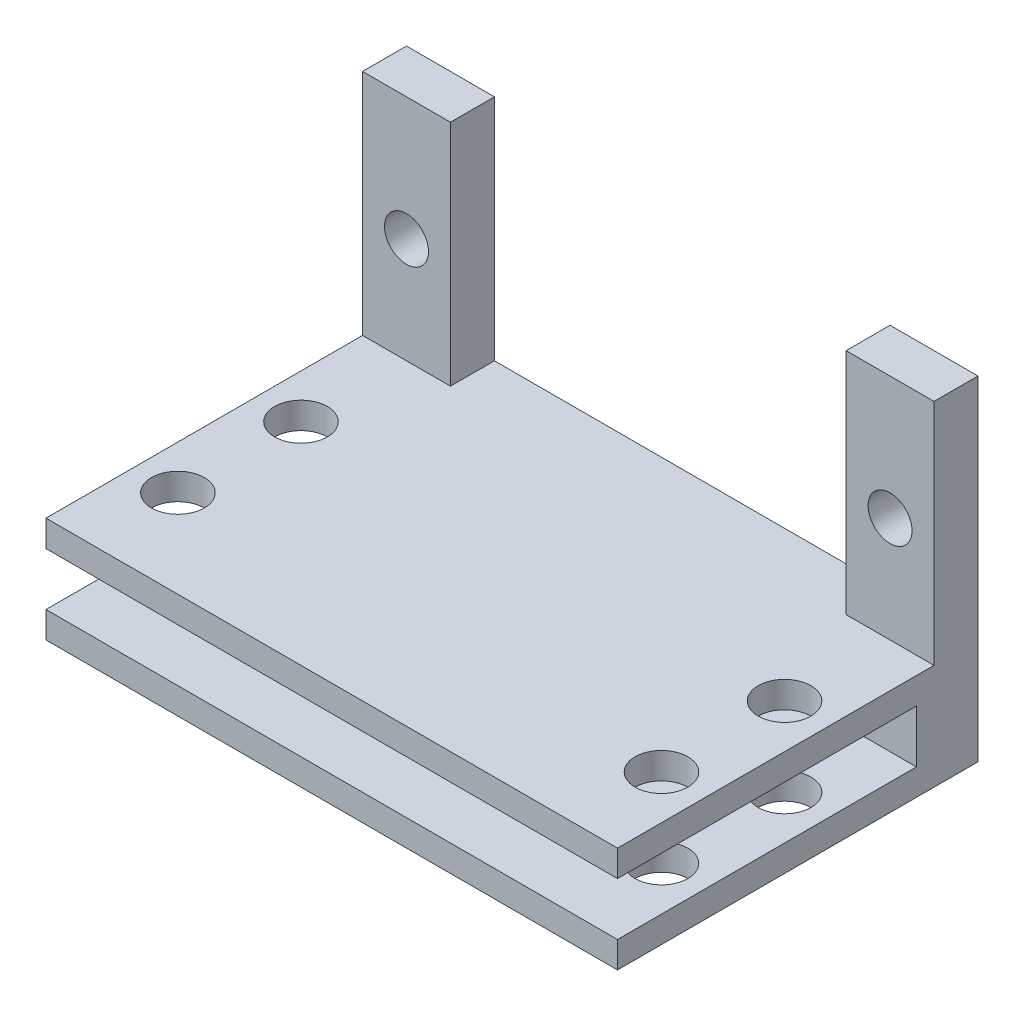
ISO-10303-21;
HEADER;
FILE_DESCRIPTION(('STEP AP214'),'2;1');
FILE_NAME('part.step','',(''),(''),'','','');
FILE_SCHEMA(('AUTOMOTIVE_DESIGN { 1 0 10303 214 1 1 1 1 }'));
ENDSEC;
DATA;
#1=APPLICATION_CONTEXT('core data for automotive mechanical design processes');
#2=APPLICATION_PROTOCOL_DEFINITION('international standard','automotive_design',2000,#1);
#3=PRODUCT_CONTEXT('',#1,'mechanical');
#4=PRODUCT('Part','Part','',(#3));
#5=PRODUCT_RELATED_PRODUCT_CATEGORY('part','',(#4));
#6=PRODUCT_DEFINITION_FORMATION('','',#4);
#7=PRODUCT_DEFINITION_CONTEXT('part definition',#1,'design');
#8=PRODUCT_DEFINITION('design','',#6,#7);
#9=PRODUCT_DEFINITION_SHAPE('','',#8);
#10=(LENGTH_UNIT() NAMED_UNIT(*) SI_UNIT(.MILLI.,.METRE.));
#11=(NAMED_UNIT(*) PLANE_ANGLE_UNIT() SI_UNIT($,.RADIAN.));
#12=(NAMED_UNIT(*) SI_UNIT($,.STERADIAN.) SOLID_ANGLE_UNIT());
#13=UNCERTAINTY_MEASURE_WITH_UNIT(LENGTH_MEASURE(1.E-05),#10,'distance_accuracy_value','');
#14=(GEOMETRIC_REPRESENTATION_CONTEXT(3) GLOBAL_UNCERTAINTY_ASSIGNED_CONTEXT((#13)) GLOBAL_UNIT_ASSIGNED_CONTEXT((#10,
#11,#12)) REPRESENTATION_CONTEXT('',''));
#15=CARTESIAN_POINT('',(0.,0.,0.));
#16=DIRECTION('',(0.,0.,1.));
#17=DIRECTION('',(1.,0.,0.));
#18=AXIS2_PLACEMENT_3D('',#15,#16,#17);
#19=CARTESIAN_POINT('',(0.,0.,20.5));
#20=DIRECTION('',(0.,1.,0.));
#21=DIRECTION('',(-1.,0.,0.));
#22=AXIS2_PLACEMENT_3D('',#19,#20,#21);
#23=PLANE('',#22);
#24=CARTESIAN_POINT('',(-13.75,0.,8.5));
#25=DIRECTION('',(0.,1.,0.));
#26=DIRECTION('',(-1.,0.,0.));
#27=AXIS2_PLACEMENT_3D('',#24,#25,#26);
#28=CIRCLE('',#27,1.5);
#29=CARTESIAN_POINT('',(-15.25,0.,8.5));
#30=VERTEX_POINT('',#29);
#31=EDGE_CURVE('E176',#30,#30,#28,.T.);
#32=ORIENTED_EDGE('',*,*,#31,.F.);
#33=EDGE_LOOP('',(#32));
#34=FACE_BOUND('',#33,.T.);
#35=CARTESIAN_POINT('',(-13.75,0.,15.5));
#36=DIRECTION('',(0.,1.,0.));
#37=DIRECTION('',(-1.,0.,0.));
#38=AXIS2_PLACEMENT_3D('',#35,#36,#37);
#39=CIRCLE('',#38,1.5);
#40=CARTESIAN_POINT('',(-15.25,0.,15.5));
#41=VERTEX_POINT('',#40);
#42=EDGE_CURVE('E417',#41,#41,#39,.T.);
#43=ORIENTED_EDGE('',*,*,#42,.F.);
#44=EDGE_LOOP('',(#43));
#45=FACE_BOUND('',#44,.T.);
#46=CARTESIAN_POINT('',(13.75,0.,15.5));
#47=DIRECTION('',(0.,1.,0.));
#48=DIRECTION('',(-1.,0.,0.));
#49=AXIS2_PLACEMENT_3D('',#46,#47,#48);
#50=CIRCLE('',#49,1.5);
#51=CARTESIAN_POINT('',(12.25,0.,15.5));
#52=VERTEX_POINT('',#51);
#53=EDGE_CURVE('E399',#52,#52,#50,.T.);
#54=ORIENTED_EDGE('',*,*,#53,.F.);
#55=EDGE_LOOP('',(#54));
#56=FACE_BOUND('',#55,.T.);
#57=CARTESIAN_POINT('',(13.75,0.,8.5));
#58=DIRECTION('',(0.,1.,0.));
#59=DIRECTION('',(-1.,0.,0.));
#60=AXIS2_PLACEMENT_3D('',#57,#58,#59);
#61=CIRCLE('',#60,1.5);
#62=CARTESIAN_POINT('',(12.25,0.,8.5));
#63=VERTEX_POINT('',#62);
#64=EDGE_CURVE('E408',#63,#63,#61,.T.);
#65=ORIENTED_EDGE('',*,*,#64,.F.);
#66=EDGE_LOOP('',(#65));
#67=FACE_BOUND('',#66,.T.);
#68=DIRECTION('',(1.,0.,0.));
#69=VECTOR('',#68,1.);
#70=CARTESIAN_POINT('',(0.,0.,0.));
#71=LINE('',#70,#69);
#72=CARTESIAN_POINT('',(-11.25,0.,0.));
#73=VERTEX_POINT('',#72);
#74=CARTESIAN_POINT('',(11.25,0.,0.));
#75=VERTEX_POINT('',#74);
#76=EDGE_CURVE('E220',#73,#75,#71,.T.);
#77=ORIENTED_EDGE('',*,*,#76,.F.);
#78=DIRECTION('',(0.,0.,-1.));
#79=VECTOR('',#78,1.);
#80=CARTESIAN_POINT('',(-11.25,0.,2.5));
#81=LINE('',#80,#79);
#82=CARTESIAN_POINT('',(-11.25,0.,2.5));
#83=VERTEX_POINT('',#82);
#84=EDGE_CURVE('E217',#83,#73,#81,.T.);
#85=ORIENTED_EDGE('',*,*,#84,.F.);
#86=DIRECTION('',(1.,0.,0.));
#87=VECTOR('',#86,1.);
#88=CARTESIAN_POINT('',(0.,0.,2.5));
#89=LINE('',#88,#87);
#90=CARTESIAN_POINT('',(-16.25,0.,2.5));
#91=VERTEX_POINT('',#90);
#92=EDGE_CURVE('E193',#91,#83,#89,.T.);
#93=ORIENTED_EDGE('',*,*,#92,.F.);
#94=DIRECTION('',(0.,0.,-1.));
#95=VECTOR('',#94,1.);
#96=CARTESIAN_POINT('',(-16.25,0.,20.5));
#97=LINE('',#96,#95);
#98=CARTESIAN_POINT('',(-16.25,0.,20.5));
#99=VERTEX_POINT('',#98);
#100=EDGE_CURVE('E237',#99,#91,#97,.T.);
#101=ORIENTED_EDGE('',*,*,#100,.F.);
#102=DIRECTION('',(1.,0.,0.));
#103=VECTOR('',#102,1.);
#104=CARTESIAN_POINT('',(0.,0.,20.5));
#105=LINE('',#104,#103);
#106=CARTESIAN_POINT('',(16.25,0.,20.5));
#107=VERTEX_POINT('',#106);
#108=EDGE_CURVE('E227',#99,#107,#105,.T.);
#109=ORIENTED_EDGE('',*,*,#108,.T.);
#110=DIRECTION('',(0.,0.,-1.));
#111=VECTOR('',#110,1.);
#112=CARTESIAN_POINT('',(16.25,0.,20.5));
#113=LINE('',#112,#111);
#114=CARTESIAN_POINT('',(16.25,0.,2.5));
#115=VERTEX_POINT('',#114);
#116=EDGE_CURVE('E240',#107,#115,#113,.T.);
#117=ORIENTED_EDGE('',*,*,#116,.T.);
#118=DIRECTION('',(1.,0.,0.));
#119=VECTOR('',#118,1.);
#120=CARTESIAN_POINT('',(0.,0.,2.5));
#121=LINE('',#120,#119);
#122=CARTESIAN_POINT('',(11.25,0.,2.5));
#123=VERTEX_POINT('',#122);
#124=EDGE_CURVE('E247',#123,#115,#121,.T.);
#125=ORIENTED_EDGE('',*,*,#124,.F.);
#126=DIRECTION('',(0.,0.,-1.));
#127=VECTOR('',#126,1.);
#128=CARTESIAN_POINT('',(11.25,0.,2.5));
#129=LINE('',#128,#127);
#130=EDGE_CURVE('E59',#123,#75,#129,.T.);
#131=ORIENTED_EDGE('',*,*,#130,.T.);
#132=EDGE_LOOP('',(#77,#85,#93,#101,#109,#117,#125,#131));
#133=FACE_BOUND('',#132,.T.);
#134=ADVANCED_FACE('F35',(#34,#45,#56,#67,#133),#23,.T.);
#135=CARTESIAN_POINT('',(16.25,0.,2.5));
#136=DIRECTION('',(-1.,0.,0.));
#137=DIRECTION('',(0.,0.,1.));
#138=AXIS2_PLACEMENT_3D('',#135,#136,#137);
#139=PLANE('',#138);
#140=DIRECTION('',(0.,1.,0.));
#141=VECTOR('',#140,1.);
#142=CARTESIAN_POINT('',(16.25,0.,0.));
#143=LINE('',#142,#141);
#144=CARTESIAN_POINT('',(16.25,-6.,0.));
#145=VERTEX_POINT('',#144);
#146=CARTESIAN_POINT('',(16.25,13.,0.));
#147=VERTEX_POINT('',#146);
#148=EDGE_CURVE('E246',#145,#147,#143,.T.);
#149=ORIENTED_EDGE('',*,*,#148,.T.);
#150=DIRECTION('',(0.,0.,-1.));
#151=VECTOR('',#150,1.);
#152=CARTESIAN_POINT('',(16.25,13.,2.5));
#153=LINE('',#152,#151);
#154=CARTESIAN_POINT('',(16.25,13.,2.5));
#155=VERTEX_POINT('',#154);
#156=EDGE_CURVE('E11',#155,#147,#153,.T.);
#157=ORIENTED_EDGE('',*,*,#156,.F.);
#158=DIRECTION('',(0.,1.,0.));
#159=VECTOR('',#158,1.);
#160=CARTESIAN_POINT('',(16.25,0.,2.5));
#161=LINE('',#160,#159);
#162=EDGE_CURVE('E80',#115,#155,#161,.T.);
#163=ORIENTED_EDGE('',*,*,#162,.F.);
#164=ORIENTED_EDGE('',*,*,#116,.F.);
#165=DIRECTION('',(0.,-1.,0.));
#166=VECTOR('',#165,1.);
#167=CARTESIAN_POINT('',(16.25,0.,20.5));
#168=LINE('',#167,#166);
#169=CARTESIAN_POINT('',(16.25,-1.5,20.5));
#170=VERTEX_POINT('',#169);
#171=EDGE_CURVE('E223',#107,#170,#168,.T.);
#172=ORIENTED_EDGE('',*,*,#171,.T.);
#173=DIRECTION('',(0.,0.,-1.));
#174=VECTOR('',#173,1.);
#175=CARTESIAN_POINT('',(16.25,-1.5,20.5));
#176=LINE('',#175,#174);
#177=CARTESIAN_POINT('',(16.25,-1.5,3.5));
#178=VERTEX_POINT('',#177);
#179=EDGE_CURVE('E243',#170,#178,#176,.T.);
#180=ORIENTED_EDGE('',*,*,#179,.T.);
#181=DIRECTION('',(0.,-1.,0.));
#182=VECTOR('',#181,1.);
#183=CARTESIAN_POINT('',(16.25,0.,3.5));
#184=LINE('',#183,#182);
#185=CARTESIAN_POINT('',(16.25,-4.5,3.5));
#186=VERTEX_POINT('',#185);
#187=EDGE_CURVE('E50',#178,#186,#184,.T.);
#188=ORIENTED_EDGE('',*,*,#187,.T.);
#189=DIRECTION('',(0.,0.,-1.));
#190=VECTOR('',#189,1.);
#191=CARTESIAN_POINT('',(16.25,-4.5,20.5));
#192=LINE('',#191,#190);
#193=CARTESIAN_POINT('',(16.25,-4.5,20.5));
#194=VERTEX_POINT('',#193);
#195=EDGE_CURVE('E166',#194,#186,#192,.T.);
#196=ORIENTED_EDGE('',*,*,#195,.F.);
#197=DIRECTION('',(0.,-1.,0.));
#198=VECTOR('',#197,1.);
#199=CARTESIAN_POINT('',(16.25,0.,20.5));
#200=LINE('',#199,#198);
#201=CARTESIAN_POINT('',(16.25,-6.,20.5));
#202=VERTEX_POINT('',#201);
#203=EDGE_CURVE('E151',#194,#202,#200,.T.);
#204=ORIENTED_EDGE('',*,*,#203,.T.);
#205=DIRECTION('',(0.,0.,-1.));
#206=VECTOR('',#205,1.);
#207=CARTESIAN_POINT('',(16.25,-6.,20.5));
#208=LINE('',#207,#206);
#209=EDGE_CURVE('E162',#202,#145,#208,.T.);
#210=ORIENTED_EDGE('',*,*,#209,.T.);
#211=EDGE_LOOP('',(#149,#157,#163,#164,#172,#180,#188,#196,#204,#210));
#212=FACE_BOUND('',#211,.T.);
#213=ADVANCED_FACE('F37',(#212),#139,.F.);
#214=CARTESIAN_POINT('',(0.,13.,2.5));
#215=DIRECTION('',(0.,-1.,0.));
#216=DIRECTION('',(1.,0.,0.));
#217=AXIS2_PLACEMENT_3D('',#214,#215,#216);
#218=PLANE('',#217);
#219=DIRECTION('',(-1.,0.,0.));
#220=VECTOR('',#219,1.);
#221=CARTESIAN_POINT('',(0.,13.,0.));
#222=LINE('',#221,#220);
#223=CARTESIAN_POINT('',(11.25,13.,0.));
#224=VERTEX_POINT('',#223);
#225=EDGE_CURVE('E259',#147,#224,#222,.T.);
#226=ORIENTED_EDGE('',*,*,#225,.T.);
#227=DIRECTION('',(0.,0.,-1.));
#228=VECTOR('',#227,1.);
#229=CARTESIAN_POINT('',(11.25,13.,2.5));
#230=LINE('',#229,#228);
#231=CARTESIAN_POINT('',(11.25,13.,2.5));
#232=VERTEX_POINT('',#231);
#233=EDGE_CURVE('E43',#232,#224,#230,.T.);
#234=ORIENTED_EDGE('',*,*,#233,.F.);
#235=DIRECTION('',(-1.,0.,0.));
#236=VECTOR('',#235,1.);
#237=CARTESIAN_POINT('',(0.,13.,2.5));
#238=LINE('',#237,#236);
#239=EDGE_CURVE('E251',#155,#232,#238,.T.);
#240=ORIENTED_EDGE('',*,*,#239,.F.);
#241=ORIENTED_EDGE('',*,*,#156,.T.);
#242=EDGE_LOOP('',(#226,#234,#240,#241));
#243=FACE_BOUND('',#242,.T.);
#244=ADVANCED_FACE('F277',(#243),#218,.F.);
#245=CARTESIAN_POINT('',(11.25,0.,2.5));
#246=DIRECTION('',(-1.,0.,0.));
#247=DIRECTION('',(0.,-1.,0.));
#248=AXIS2_PLACEMENT_3D('',#245,#246,#247);
#249=PLANE('',#248);
#250=DIRECTION('',(0.,1.,0.));
#251=VECTOR('',#250,1.);
#252=CARTESIAN_POINT('',(11.25,0.,0.));
#253=LINE('',#252,#251);
#254=EDGE_CURVE('E261',#75,#224,#253,.T.);
#255=ORIENTED_EDGE('',*,*,#254,.F.);
#256=ORIENTED_EDGE('',*,*,#130,.F.);
#257=DIRECTION('',(0.,1.,0.));
#258=VECTOR('',#257,1.);
#259=CARTESIAN_POINT('',(11.25,0.,2.5));
#260=LINE('',#259,#258);
#261=EDGE_CURVE('E253',#123,#232,#260,.T.);
#262=ORIENTED_EDGE('',*,*,#261,.T.);
#263=ORIENTED_EDGE('',*,*,#233,.T.);
#264=EDGE_LOOP('',(#255,#256,#262,#263));
#265=FACE_BOUND('',#264,.T.);
#266=ADVANCED_FACE('F274',(#265),#249,.T.);
#267=CARTESIAN_POINT('',(13.75,6.,2.5));
#268=DIRECTION('',(0.,0.,-1.));
#269=DIRECTION('',(-1.,0.,0.));
#270=AXIS2_PLACEMENT_3D('',#267,#268,#269);
#271=CYLINDRICAL_SURFACE('',#270,1.25);
#272=CARTESIAN_POINT('',(13.75,6.,2.5));
#273=DIRECTION('',(0.,0.,1.));
#274=DIRECTION('',(1.,0.,0.));
#275=AXIS2_PLACEMENT_3D('',#272,#273,#274);
#276=CIRCLE('',#275,1.25);
#277=CARTESIAN_POINT('',(15.,6.,2.5));
#278=VERTEX_POINT('',#277);
#279=EDGE_CURVE('E255',#278,#278,#276,.F.);
#280=ORIENTED_EDGE('',*,*,#279,.F.);
#281=EDGE_LOOP('',(#280));
#282=FACE_BOUND('',#281,.T.);
#283=CARTESIAN_POINT('',(13.75,6.,0.));
#284=DIRECTION('',(0.,0.,1.));
#285=DIRECTION('',(1.,0.,0.));
#286=AXIS2_PLACEMENT_3D('',#283,#284,#285);
#287=CIRCLE('',#286,1.25);
#288=CARTESIAN_POINT('',(15.,6.,0.));
#289=VERTEX_POINT('',#288);
#290=EDGE_CURVE('E249',#289,#289,#287,.F.);
#291=ORIENTED_EDGE('',*,*,#290,.T.);
#292=EDGE_LOOP('',(#291));
#293=FACE_BOUND('',#292,.T.);
#294=ADVANCED_FACE('F276',(#282,#293),#271,.F.);
#295=CARTESIAN_POINT('',(0.,0.,2.5));
#296=DIRECTION('',(0.,0.,1.));
#297=DIRECTION('',(1.,0.,0.));
#298=AXIS2_PLACEMENT_3D('',#295,#296,#297);
#299=PLANE('',#298);
#300=ORIENTED_EDGE('',*,*,#124,.T.);
#301=ORIENTED_EDGE('',*,*,#162,.T.);
#302=ORIENTED_EDGE('',*,*,#239,.T.);
#303=ORIENTED_EDGE('',*,*,#261,.F.);
#304=EDGE_LOOP('',(#300,#301,#302,#303));
#305=FACE_BOUND('',#304,.T.);
#306=ORIENTED_EDGE('',*,*,#279,.T.);
#307=EDGE_LOOP('',(#306));
#308=FACE_BOUND('',#307,.T.);
#309=ADVANCED_FACE('F271',(#305,#308),#299,.T.);
#310=CARTESIAN_POINT('',(0.,0.,0.));
#311=DIRECTION('',(0.,0.,1.));
#312=DIRECTION('',(1.,0.,0.));
#313=AXIS2_PLACEMENT_3D('',#310,#311,#312);
#314=PLANE('',#313);
#315=ORIENTED_EDGE('',*,*,#148,.F.);
#316=DIRECTION('',(1.,0.,0.));
#317=VECTOR('',#316,1.);
#318=CARTESIAN_POINT('',(0.,-6.,0.));
#319=LINE('',#318,#317);
#320=CARTESIAN_POINT('',(-16.25,-6.,0.));
#321=VERTEX_POINT('',#320);
#322=EDGE_CURVE('E158',#321,#145,#319,.T.);
#323=ORIENTED_EDGE('',*,*,#322,.F.);
#324=DIRECTION('',(0.,-1.,0.));
#325=VECTOR('',#324,1.);
#326=CARTESIAN_POINT('',(-16.25,0.,0.));
#327=LINE('',#326,#325);
#328=CARTESIAN_POINT('',(-16.25,13.,0.));
#329=VERTEX_POINT('',#328);
#330=EDGE_CURVE('E224',#329,#321,#327,.T.);
#331=ORIENTED_EDGE('',*,*,#330,.F.);
#332=DIRECTION('',(1.,0.,0.));
#333=VECTOR('',#332,1.);
#334=CARTESIAN_POINT('',(0.,13.,0.));
#335=LINE('',#334,#333);
#336=CARTESIAN_POINT('',(-11.25,13.,0.));
#337=VERTEX_POINT('',#336);
#338=EDGE_CURVE('E194',#329,#337,#335,.T.);
#339=ORIENTED_EDGE('',*,*,#338,.T.);
#340=DIRECTION('',(0.,1.,0.));
#341=VECTOR('',#340,1.);
#342=CARTESIAN_POINT('',(-11.25,0.,0.));
#343=LINE('',#342,#341);
#344=EDGE_CURVE('E208',#73,#337,#343,.T.);
#345=ORIENTED_EDGE('',*,*,#344,.F.);
#346=ORIENTED_EDGE('',*,*,#76,.T.);
#347=ORIENTED_EDGE('',*,*,#254,.T.);
#348=ORIENTED_EDGE('',*,*,#225,.F.);
#349=EDGE_LOOP('',(#315,#323,#331,#339,#345,#346,#347,#348));
#350=FACE_BOUND('',#349,.T.);
#351=ORIENTED_EDGE('',*,*,#290,.F.);
#352=EDGE_LOOP('',(#351));
#353=FACE_BOUND('',#352,.T.);
#354=CARTESIAN_POINT('',(-13.75,6.,0.));
#355=DIRECTION('',(0.,0.,1.));
#356=DIRECTION('',(1.,0.,0.));
#357=AXIS2_PLACEMENT_3D('',#354,#355,#356);
#358=CIRCLE('',#357,1.25);
#359=CARTESIAN_POINT('',(-12.5,6.,0.));
#360=VERTEX_POINT('',#359);
#361=EDGE_CURVE('E189',#360,#360,#358,.T.);
#362=ORIENTED_EDGE('',*,*,#361,.T.);
#363=EDGE_LOOP('',(#362));
#364=FACE_BOUND('',#363,.T.);
#365=ADVANCED_FACE('F301',(#350,#353,#364),#314,.F.);
#366=CARTESIAN_POINT('',(0.,-1.5,20.5));
#367=DIRECTION('',(0.,1.,0.));
#368=DIRECTION('',(-1.,0.,0.));
#369=AXIS2_PLACEMENT_3D('',#366,#367,#368);
#370=PLANE('',#369);
#371=CARTESIAN_POINT('',(-13.75,-1.5,8.5));
#372=DIRECTION('',(0.,1.,0.));
#373=DIRECTION('',(-1.,0.,0.));
#374=AXIS2_PLACEMENT_3D('',#371,#372,#373);
#375=CIRCLE('',#374,1.5);
#376=CARTESIAN_POINT('',(-15.25,-1.5,8.5));
#377=VERTEX_POINT('',#376);
#378=EDGE_CURVE('E423',#377,#377,#375,.T.);
#379=ORIENTED_EDGE('',*,*,#378,.T.);
#380=EDGE_LOOP('',(#379));
#381=FACE_BOUND('',#380,.T.);
#382=CARTESIAN_POINT('',(-13.75,-1.5,15.5));
#383=DIRECTION('',(0.,1.,0.));
#384=DIRECTION('',(-1.,0.,0.));
#385=AXIS2_PLACEMENT_3D('',#382,#383,#384);
#386=CIRCLE('',#385,1.5);
#387=CARTESIAN_POINT('',(-15.25,-1.5,15.5));
#388=VERTEX_POINT('',#387);
#389=EDGE_CURVE('E414',#388,#388,#386,.T.);
#390=ORIENTED_EDGE('',*,*,#389,.T.);
#391=EDGE_LOOP('',(#390));
#392=FACE_BOUND('',#391,.T.);
#393=CARTESIAN_POINT('',(13.75,-1.5,15.5));
#394=DIRECTION('',(0.,1.,0.));
#395=DIRECTION('',(-1.,0.,0.));
#396=AXIS2_PLACEMENT_3D('',#393,#394,#395);
#397=CIRCLE('',#396,1.5);
#398=CARTESIAN_POINT('',(12.25,-1.5,15.5));
#399=VERTEX_POINT('',#398);
#400=EDGE_CURVE('E402',#399,#399,#397,.T.);
#401=ORIENTED_EDGE('',*,*,#400,.T.);
#402=EDGE_LOOP('',(#401));
#403=FACE_BOUND('',#402,.T.);
#404=CARTESIAN_POINT('',(13.75,-1.5,8.5));
#405=DIRECTION('',(0.,1.,0.));
#406=DIRECTION('',(-1.,0.,0.));
#407=AXIS2_PLACEMENT_3D('',#404,#405,#406);
#408=CIRCLE('',#407,1.5);
#409=CARTESIAN_POINT('',(12.25,-1.5,8.5));
#410=VERTEX_POINT('',#409);
#411=EDGE_CURVE('E435',#410,#410,#408,.T.);
#412=ORIENTED_EDGE('',*,*,#411,.T.);
#413=EDGE_LOOP('',(#412));
#414=FACE_BOUND('',#413,.T.);
#415=DIRECTION('',(0.,0.,-1.));
#416=VECTOR('',#415,1.);
#417=CARTESIAN_POINT('',(-16.25,-1.5,20.5));
#418=LINE('',#417,#416);
#419=CARTESIAN_POINT('',(-16.25,-1.5,20.5));
#420=VERTEX_POINT('',#419);
#421=CARTESIAN_POINT('',(-16.25,-1.5,3.5));
#422=VERTEX_POINT('',#421);
#423=EDGE_CURVE('E232',#420,#422,#418,.T.);
#424=ORIENTED_EDGE('',*,*,#423,.T.);
#425=DIRECTION('',(1.,0.,0.));
#426=VECTOR('',#425,1.);
#427=CARTESIAN_POINT('',(0.,-1.5,3.5));
#428=LINE('',#427,#426);
#429=EDGE_CURVE('E184',#422,#178,#428,.T.);
#430=ORIENTED_EDGE('',*,*,#429,.T.);
#431=ORIENTED_EDGE('',*,*,#179,.F.);
#432=DIRECTION('',(1.,0.,0.));
#433=VECTOR('',#432,1.);
#434=CARTESIAN_POINT('',(0.,-1.5,20.5));
#435=LINE('',#434,#433);
#436=EDGE_CURVE('E221',#420,#170,#435,.T.);
#437=ORIENTED_EDGE('',*,*,#436,.F.);
#438=EDGE_LOOP('',(#424,#430,#431,#437));
#439=FACE_BOUND('',#438,.T.);
#440=ADVANCED_FACE('F298',(#381,#392,#403,#414,#439),#370,.F.);
#441=CARTESIAN_POINT('',(-16.25,0.,20.5));
#442=DIRECTION('',(1.,0.,0.));
#443=DIRECTION('',(0.,0.,-1.));
#444=AXIS2_PLACEMENT_3D('',#441,#442,#443);
#445=PLANE('',#444);
#446=ORIENTED_EDGE('',*,*,#330,.T.);
#447=DIRECTION('',(0.,0.,-1.));
#448=VECTOR('',#447,1.);
#449=CARTESIAN_POINT('',(-16.25,-6.,20.5));
#450=LINE('',#449,#448);
#451=CARTESIAN_POINT('',(-16.25,-6.,20.5));
#452=VERTEX_POINT('',#451);
#453=EDGE_CURVE('E174',#452,#321,#450,.T.);
#454=ORIENTED_EDGE('',*,*,#453,.F.);
#455=DIRECTION('',(0.,-1.,0.));
#456=VECTOR('',#455,1.);
#457=CARTESIAN_POINT('',(-16.25,0.,20.5));
#458=LINE('',#457,#456);
#459=CARTESIAN_POINT('',(-16.25,-4.5,20.5));
#460=VERTEX_POINT('',#459);
#461=EDGE_CURVE('E154',#460,#452,#458,.T.);
#462=ORIENTED_EDGE('',*,*,#461,.F.);
#463=DIRECTION('',(0.,0.,-1.));
#464=VECTOR('',#463,1.);
#465=CARTESIAN_POINT('',(-16.25,-4.5,20.5));
#466=LINE('',#465,#464);
#467=CARTESIAN_POINT('',(-16.25,-4.5,3.5));
#468=VERTEX_POINT('',#467);
#469=EDGE_CURVE('E178',#460,#468,#466,.T.);
#470=ORIENTED_EDGE('',*,*,#469,.T.);
#471=DIRECTION('',(0.,-1.,0.));
#472=VECTOR('',#471,1.);
#473=CARTESIAN_POINT('',(-16.25,0.,3.5));
#474=LINE('',#473,#472);
#475=EDGE_CURVE('E186',#422,#468,#474,.T.);
#476=ORIENTED_EDGE('',*,*,#475,.F.);
#477=ORIENTED_EDGE('',*,*,#423,.F.);
#478=DIRECTION('',(0.,-1.,0.));
#479=VECTOR('',#478,1.);
#480=CARTESIAN_POINT('',(-16.25,0.,20.5));
#481=LINE('',#480,#479);
#482=EDGE_CURVE('E230',#99,#420,#481,.T.);
#483=ORIENTED_EDGE('',*,*,#482,.F.);
#484=ORIENTED_EDGE('',*,*,#100,.T.);
#485=DIRECTION('',(0.,1.,0.));
#486=VECTOR('',#485,1.);
#487=CARTESIAN_POINT('',(-16.25,0.,2.5));
#488=LINE('',#487,#486);
#489=CARTESIAN_POINT('',(-16.25,13.,2.5));
#490=VERTEX_POINT('',#489);
#491=EDGE_CURVE('E202',#91,#490,#488,.T.);
#492=ORIENTED_EDGE('',*,*,#491,.T.);
#493=DIRECTION('',(0.,0.,-1.));
#494=VECTOR('',#493,1.);
#495=CARTESIAN_POINT('',(-16.25,13.,2.5));
#496=LINE('',#495,#494);
#497=EDGE_CURVE('E205',#490,#329,#496,.T.);
#498=ORIENTED_EDGE('',*,*,#497,.T.);
#499=EDGE_LOOP('',(#446,#454,#462,#470,#476,#477,#483,#484,#492,#498));
#500=FACE_BOUND('',#499,.T.);
#501=ADVANCED_FACE('F296',(#500),#445,.F.);
#502=CARTESIAN_POINT('',(0.,0.,20.5));
#503=DIRECTION('',(0.,0.,1.));
#504=DIRECTION('',(1.,0.,0.));
#505=AXIS2_PLACEMENT_3D('',#502,#503,#504);
#506=PLANE('',#505);
#507=ORIENTED_EDGE('',*,*,#436,.T.);
#508=ORIENTED_EDGE('',*,*,#171,.F.);
#509=ORIENTED_EDGE('',*,*,#108,.F.);
#510=ORIENTED_EDGE('',*,*,#482,.T.);
#511=EDGE_LOOP('',(#507,#508,#509,#510));
#512=FACE_BOUND('',#511,.T.);
#513=ADVANCED_FACE('F332',(#512),#506,.T.);
#514=CARTESIAN_POINT('',(-11.25,0.,2.5));
#515=DIRECTION('',(-1.,0.,0.));
#516=DIRECTION('',(0.,-1.,0.));
#517=AXIS2_PLACEMENT_3D('',#514,#515,#516);
#518=PLANE('',#517);
#519=ORIENTED_EDGE('',*,*,#344,.T.);
#520=DIRECTION('',(0.,0.,-1.));
#521=VECTOR('',#520,1.);
#522=CARTESIAN_POINT('',(-11.25,13.,2.5));
#523=LINE('',#522,#521);
#524=CARTESIAN_POINT('',(-11.25,13.,2.5));
#525=VERTEX_POINT('',#524);
#526=EDGE_CURVE('E215',#525,#337,#523,.T.);
#527=ORIENTED_EDGE('',*,*,#526,.F.);
#528=DIRECTION('',(0.,1.,0.));
#529=VECTOR('',#528,1.);
#530=CARTESIAN_POINT('',(-11.25,0.,2.5));
#531=LINE('',#530,#529);
#532=EDGE_CURVE('E197',#83,#525,#531,.T.);
#533=ORIENTED_EDGE('',*,*,#532,.F.);
#534=ORIENTED_EDGE('',*,*,#84,.T.);
#535=EDGE_LOOP('',(#519,#527,#533,#534));
#536=FACE_BOUND('',#535,.T.);
#537=ADVANCED_FACE('F328',(#536),#518,.F.);
#538=CARTESIAN_POINT('',(0.,13.,2.5));
#539=DIRECTION('',(0.,1.,0.));
#540=DIRECTION('',(-1.,0.,0.));
#541=AXIS2_PLACEMENT_3D('',#538,#539,#540);
#542=PLANE('',#541);
#543=ORIENTED_EDGE('',*,*,#338,.F.);
#544=ORIENTED_EDGE('',*,*,#497,.F.);
#545=DIRECTION('',(1.,0.,0.));
#546=VECTOR('',#545,1.);
#547=CARTESIAN_POINT('',(0.,13.,2.5));
#548=LINE('',#547,#546);
#549=EDGE_CURVE('E199',#490,#525,#548,.T.);
#550=ORIENTED_EDGE('',*,*,#549,.T.);
#551=ORIENTED_EDGE('',*,*,#526,.T.);
#552=EDGE_LOOP('',(#543,#544,#550,#551));
#553=FACE_BOUND('',#552,.T.);
#554=ADVANCED_FACE('F318',(#553),#542,.T.);
#555=CARTESIAN_POINT('',(-13.75,6.,2.5));
#556=DIRECTION('',(0.,0.,-1.));
#557=DIRECTION('',(-1.,0.,0.));
#558=AXIS2_PLACEMENT_3D('',#555,#556,#557);
#559=CYLINDRICAL_SURFACE('',#558,1.25);
#560=CARTESIAN_POINT('',(-13.75,6.,2.5));
#561=DIRECTION('',(0.,0.,1.));
#562=DIRECTION('',(1.,0.,0.));
#563=AXIS2_PLACEMENT_3D('',#560,#561,#562);
#564=CIRCLE('',#563,1.25);
#565=CARTESIAN_POINT('',(-12.5,6.,2.5));
#566=VERTEX_POINT('',#565);
#567=EDGE_CURVE('E190',#566,#566,#564,.T.);
#568=ORIENTED_EDGE('',*,*,#567,.T.);
#569=EDGE_LOOP('',(#568));
#570=FACE_BOUND('',#569,.T.);
#571=ORIENTED_EDGE('',*,*,#361,.F.);
#572=EDGE_LOOP('',(#571));
#573=FACE_BOUND('',#572,.T.);
#574=ADVANCED_FACE('F315',(#570,#573),#559,.F.);
#575=CARTESIAN_POINT('',(0.,0.,2.5));
#576=DIRECTION('',(0.,0.,1.));
#577=DIRECTION('',(1.,0.,0.));
#578=AXIS2_PLACEMENT_3D('',#575,#576,#577);
#579=PLANE('',#578);
#580=ORIENTED_EDGE('',*,*,#567,.F.);
#581=EDGE_LOOP('',(#580));
#582=FACE_BOUND('',#581,.T.);
#583=ORIENTED_EDGE('',*,*,#92,.T.);
#584=ORIENTED_EDGE('',*,*,#532,.T.);
#585=ORIENTED_EDGE('',*,*,#549,.F.);
#586=ORIENTED_EDGE('',*,*,#491,.F.);
#587=EDGE_LOOP('',(#583,#584,#585,#586));
#588=FACE_BOUND('',#587,.T.);
#589=ADVANCED_FACE('F317',(#582,#588),#579,.T.);
#590=CARTESIAN_POINT('',(0.,0.,3.5));
#591=DIRECTION('',(0.,0.,1.));
#592=DIRECTION('',(1.,0.,0.));
#593=AXIS2_PLACEMENT_3D('',#590,#591,#592);
#594=PLANE('',#593);
#595=DIRECTION('',(1.,0.,0.));
#596=VECTOR('',#595,1.);
#597=CARTESIAN_POINT('',(0.,-4.5,3.5));
#598=LINE('',#597,#596);
#599=EDGE_CURVE('E165',#468,#186,#598,.T.);
#600=ORIENTED_EDGE('',*,*,#599,.T.);
#601=ORIENTED_EDGE('',*,*,#187,.F.);
#602=ORIENTED_EDGE('',*,*,#429,.F.);
#603=ORIENTED_EDGE('',*,*,#475,.T.);
#604=EDGE_LOOP('',(#600,#601,#602,#603));
#605=FACE_BOUND('',#604,.T.);
#606=ADVANCED_FACE('F325',(#605),#594,.T.);
#607=CARTESIAN_POINT('',(0.,-4.5,20.5));
#608=DIRECTION('',(0.,1.,0.));
#609=DIRECTION('',(-1.,0.,0.));
#610=AXIS2_PLACEMENT_3D('',#607,#608,#609);
#611=PLANE('',#610);
#612=CARTESIAN_POINT('',(-13.75,-4.5,8.5));
#613=DIRECTION('',(0.,1.,0.));
#614=DIRECTION('',(-1.,0.,0.));
#615=AXIS2_PLACEMENT_3D('',#612,#613,#614);
#616=CIRCLE('',#615,1.5);
#617=CARTESIAN_POINT('',(-15.25,-4.5,8.5));
#618=VERTEX_POINT('',#617);
#619=EDGE_CURVE('E420',#618,#618,#616,.T.);
#620=ORIENTED_EDGE('',*,*,#619,.F.);
#621=EDGE_LOOP('',(#620));
#622=FACE_BOUND('',#621,.T.);
#623=CARTESIAN_POINT('',(-13.75,-4.5,15.5));
#624=DIRECTION('',(0.,1.,0.));
#625=DIRECTION('',(-1.,0.,0.));
#626=AXIS2_PLACEMENT_3D('',#623,#624,#625);
#627=CIRCLE('',#626,1.5);
#628=CARTESIAN_POINT('',(-15.25,-4.5,15.5));
#629=VERTEX_POINT('',#628);
#630=EDGE_CURVE('E406',#629,#629,#627,.T.);
#631=ORIENTED_EDGE('',*,*,#630,.F.);
#632=EDGE_LOOP('',(#631));
#633=FACE_BOUND('',#632,.T.);
#634=CARTESIAN_POINT('',(13.75,-4.5,15.5));
#635=DIRECTION('',(0.,1.,0.));
#636=DIRECTION('',(-1.,0.,0.));
#637=AXIS2_PLACEMENT_3D('',#634,#635,#636);
#638=CIRCLE('',#637,1.5);
#639=CARTESIAN_POINT('',(12.25,-4.5,15.5));
#640=VERTEX_POINT('',#639);
#641=EDGE_CURVE('E404',#640,#640,#638,.T.);
#642=ORIENTED_EDGE('',*,*,#641,.F.);
#643=EDGE_LOOP('',(#642));
#644=FACE_BOUND('',#643,.T.);
#645=CARTESIAN_POINT('',(13.75,-4.5,8.5));
#646=DIRECTION('',(0.,1.,0.));
#647=DIRECTION('',(-1.,0.,0.));
#648=AXIS2_PLACEMENT_3D('',#645,#646,#647);
#649=CIRCLE('',#648,1.5);
#650=CARTESIAN_POINT('',(12.25,-4.5,8.5));
#651=VERTEX_POINT('',#650);
#652=EDGE_CURVE('E437',#651,#651,#649,.T.);
#653=ORIENTED_EDGE('',*,*,#652,.F.);
#654=EDGE_LOOP('',(#653));
#655=FACE_BOUND('',#654,.T.);
#656=ORIENTED_EDGE('',*,*,#599,.F.);
#657=ORIENTED_EDGE('',*,*,#469,.F.);
#658=DIRECTION('',(1.,0.,0.));
#659=VECTOR('',#658,1.);
#660=CARTESIAN_POINT('',(0.,-4.5,20.5));
#661=LINE('',#660,#659);
#662=EDGE_CURVE('E168',#460,#194,#661,.T.);
#663=ORIENTED_EDGE('',*,*,#662,.T.);
#664=ORIENTED_EDGE('',*,*,#195,.T.);
#665=EDGE_LOOP('',(#656,#657,#663,#664));
#666=FACE_BOUND('',#665,.T.);
#667=ADVANCED_FACE('F349',(#622,#633,#644,#655,#666),#611,.T.);
#668=CARTESIAN_POINT('',(0.,-6.,20.5));
#669=DIRECTION('',(0.,1.,0.));
#670=DIRECTION('',(-1.,0.,0.));
#671=AXIS2_PLACEMENT_3D('',#668,#669,#670);
#672=PLANE('',#671);
#673=CARTESIAN_POINT('',(-13.75,-6.00000000000001,8.5));
#674=DIRECTION('',(0.,1.,0.));
#675=DIRECTION('',(1.,0.,0.));
#676=AXIS2_PLACEMENT_3D('',#673,#674,#675);
#677=CIRCLE('',#676,1.5);
#678=CARTESIAN_POINT('',(-12.25,-6.00000000000001,8.5));
#679=VERTEX_POINT('',#678);
#680=EDGE_CURVE('E447',#679,#679,#677,.T.);
#681=ORIENTED_EDGE('',*,*,#680,.T.);
#682=EDGE_LOOP('',(#681));
#683=FACE_BOUND('',#682,.T.);
#684=CARTESIAN_POINT('',(-13.75,-6.00000000000001,15.5));
#685=DIRECTION('',(0.,1.,0.));
#686=DIRECTION('',(1.,0.,0.));
#687=AXIS2_PLACEMENT_3D('',#684,#685,#686);
#688=CIRCLE('',#687,1.5);
#689=CARTESIAN_POINT('',(-12.25,-6.00000000000001,15.5));
#690=VERTEX_POINT('',#689);
#691=EDGE_CURVE('E450',#690,#690,#688,.T.);
#692=ORIENTED_EDGE('',*,*,#691,.T.);
#693=EDGE_LOOP('',(#692));
#694=FACE_BOUND('',#693,.T.);
#695=CARTESIAN_POINT('',(13.75,-6.,15.5));
#696=DIRECTION('',(0.,1.,0.));
#697=DIRECTION('',(-1.,0.,0.));
#698=AXIS2_PLACEMENT_3D('',#695,#696,#697);
#699=CIRCLE('',#698,1.5);
#700=CARTESIAN_POINT('',(12.25,-6.,15.5));
#701=VERTEX_POINT('',#700);
#702=EDGE_CURVE('E446',#701,#701,#699,.T.);
#703=ORIENTED_EDGE('',*,*,#702,.T.);
#704=EDGE_LOOP('',(#703));
#705=FACE_BOUND('',#704,.T.);
#706=CARTESIAN_POINT('',(13.75,-6.,8.5));
#707=DIRECTION('',(0.,1.,0.));
#708=DIRECTION('',(-1.,0.,0.));
#709=AXIS2_PLACEMENT_3D('',#706,#707,#708);
#710=CIRCLE('',#709,1.5);
#711=CARTESIAN_POINT('',(12.25,-6.,8.5));
#712=VERTEX_POINT('',#711);
#713=EDGE_CURVE('E441',#712,#712,#710,.T.);
#714=ORIENTED_EDGE('',*,*,#713,.T.);
#715=EDGE_LOOP('',(#714));
#716=FACE_BOUND('',#715,.T.);
#717=ORIENTED_EDGE('',*,*,#322,.T.);
#718=ORIENTED_EDGE('',*,*,#209,.F.);
#719=DIRECTION('',(1.,0.,0.));
#720=VECTOR('',#719,1.);
#721=CARTESIAN_POINT('',(0.,-6.,20.5));
#722=LINE('',#721,#720);
#723=EDGE_CURVE('E146',#452,#202,#722,.T.);
#724=ORIENTED_EDGE('',*,*,#723,.F.);
#725=ORIENTED_EDGE('',*,*,#453,.T.);
#726=EDGE_LOOP('',(#717,#718,#724,#725));
#727=FACE_BOUND('',#726,.T.);
#728=ADVANCED_FACE('F163',(#683,#694,#705,#716,#727),#672,.F.);
#729=CARTESIAN_POINT('',(0.,0.,20.5));
#730=DIRECTION('',(0.,0.,1.));
#731=DIRECTION('',(1.,0.,0.));
#732=AXIS2_PLACEMENT_3D('',#729,#730,#731);
#733=PLANE('',#732);
#734=ORIENTED_EDGE('',*,*,#723,.T.);
#735=ORIENTED_EDGE('',*,*,#203,.F.);
#736=ORIENTED_EDGE('',*,*,#662,.F.);
#737=ORIENTED_EDGE('',*,*,#461,.T.);
#738=EDGE_LOOP('',(#734,#735,#736,#737));
#739=FACE_BOUND('',#738,.T.);
#740=ADVANCED_FACE('F148',(#739),#733,.T.);
#741=CARTESIAN_POINT('',(13.75,-6.,8.5));
#742=DIRECTION('',(0.,1.,0.));
#743=DIRECTION('',(-1.,0.,0.));
#744=AXIS2_PLACEMENT_3D('',#741,#742,#743);
#745=CYLINDRICAL_SURFACE('',#744,1.5);
#746=ORIENTED_EDGE('',*,*,#652,.T.);
#747=EDGE_LOOP('',(#746));
#748=FACE_BOUND('',#747,.T.);
#749=ORIENTED_EDGE('',*,*,#713,.F.);
#750=EDGE_LOOP('',(#749));
#751=FACE_BOUND('',#750,.T.);
#752=ADVANCED_FACE('F365',(#748,#751),#745,.F.);
#753=CARTESIAN_POINT('',(13.75,-6.,15.5));
#754=DIRECTION('',(0.,1.,0.));
#755=DIRECTION('',(-1.,0.,0.));
#756=AXIS2_PLACEMENT_3D('',#753,#754,#755);
#757=CYLINDRICAL_SURFACE('',#756,1.5);
#758=ORIENTED_EDGE('',*,*,#641,.T.);
#759=EDGE_LOOP('',(#758));
#760=FACE_BOUND('',#759,.T.);
#761=ORIENTED_EDGE('',*,*,#702,.F.);
#762=EDGE_LOOP('',(#761));
#763=FACE_BOUND('',#762,.T.);
#764=ADVANCED_FACE('F368',(#760,#763),#757,.F.);
#765=CARTESIAN_POINT('',(-13.75,-6.00000000000001,15.5));
#766=DIRECTION('',(0.,1.,0.));
#767=DIRECTION('',(-1.,0.,0.));
#768=AXIS2_PLACEMENT_3D('',#765,#766,#767);
#769=CYLINDRICAL_SURFACE('',#768,1.5);
#770=ORIENTED_EDGE('',*,*,#630,.T.);
#771=EDGE_LOOP('',(#770));
#772=FACE_BOUND('',#771,.T.);
#773=ORIENTED_EDGE('',*,*,#691,.F.);
#774=EDGE_LOOP('',(#773));
#775=FACE_BOUND('',#774,.T.);
#776=ADVANCED_FACE('F374',(#772,#775),#769,.F.);
#777=CARTESIAN_POINT('',(-13.75,-6.00000000000001,8.5));
#778=DIRECTION('',(0.,1.,0.));
#779=DIRECTION('',(-1.,0.,0.));
#780=AXIS2_PLACEMENT_3D('',#777,#778,#779);
#781=CYLINDRICAL_SURFACE('',#780,1.5);
#782=ORIENTED_EDGE('',*,*,#619,.T.);
#783=EDGE_LOOP('',(#782));
#784=FACE_BOUND('',#783,.T.);
#785=ORIENTED_EDGE('',*,*,#680,.F.);
#786=EDGE_LOOP('',(#785));
#787=FACE_BOUND('',#786,.T.);
#788=ADVANCED_FACE('F371',(#784,#787),#781,.F.);
#789=ORIENTED_EDGE('',*,*,#64,.T.);
#790=EDGE_LOOP('',(#789));
#791=FACE_BOUND('',#790,.T.);
#792=ORIENTED_EDGE('',*,*,#411,.F.);
#793=EDGE_LOOP('',(#792));
#794=FACE_BOUND('',#793,.T.);
#795=ADVANCED_FACE('F370',(#791,#794),#745,.F.);
#796=ORIENTED_EDGE('',*,*,#53,.T.);
#797=EDGE_LOOP('',(#796));
#798=FACE_BOUND('',#797,.T.);
#799=ORIENTED_EDGE('',*,*,#400,.F.);
#800=EDGE_LOOP('',(#799));
#801=FACE_BOUND('',#800,.T.);
#802=ADVANCED_FACE('F383',(#798,#801),#757,.F.);
#803=ORIENTED_EDGE('',*,*,#42,.T.);
#804=EDGE_LOOP('',(#803));
#805=FACE_BOUND('',#804,.T.);
#806=ORIENTED_EDGE('',*,*,#389,.F.);
#807=EDGE_LOOP('',(#806));
#808=FACE_BOUND('',#807,.T.);
#809=ADVANCED_FACE('F380',(#805,#808),#769,.F.);
#810=ORIENTED_EDGE('',*,*,#31,.T.);
#811=EDGE_LOOP('',(#810));
#812=FACE_BOUND('',#811,.T.);
#813=ORIENTED_EDGE('',*,*,#378,.F.);
#814=EDGE_LOOP('',(#813));
#815=FACE_BOUND('',#814,.T.);
#816=ADVANCED_FACE('F376',(#812,#815),#781,.F.);
#817=CLOSED_SHELL('',(#134,#213,#244,#266,#294,#309,#365,#440,#501,#513,#537,#554,#574,#589,
#606,#667,#728,#740,#752,#764,#776,#788,#795,#802,#809,#816));
#818=MANIFOLD_SOLID_BREP('B2',#817);
#819=ADVANCED_BREP_SHAPE_REPRESENTATION('',(#18,#818),#14);
#820=SHAPE_DEFINITION_REPRESENTATION(#9,#819);
ENDSEC;
END-ISO-10303-21;
